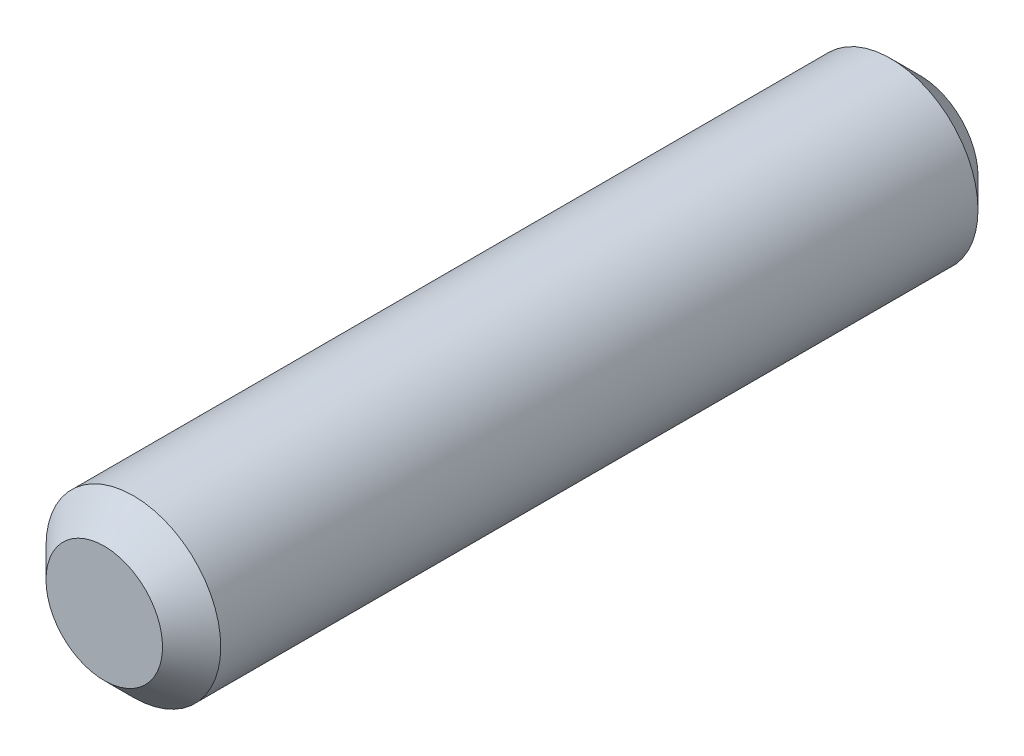
ISO-10303-21;
HEADER;
FILE_DESCRIPTION(('STEP AP214'),'2;1');
FILE_NAME('part.step','',(''),(''),'','','');
FILE_SCHEMA(('AUTOMOTIVE_DESIGN { 1 0 10303 214 1 1 1 1 }'));
ENDSEC;
DATA;
#1=APPLICATION_CONTEXT('core data for automotive mechanical design processes');
#2=APPLICATION_PROTOCOL_DEFINITION('international standard','automotive_design',2000,#1);
#3=PRODUCT_CONTEXT('',#1,'mechanical');
#4=PRODUCT('Part','Part','',(#3));
#5=PRODUCT_RELATED_PRODUCT_CATEGORY('part','',(#4));
#6=PRODUCT_DEFINITION_FORMATION('','',#4);
#7=PRODUCT_DEFINITION_CONTEXT('part definition',#1,'design');
#8=PRODUCT_DEFINITION('design','',#6,#7);
#9=PRODUCT_DEFINITION_SHAPE('','',#8);
#10=(LENGTH_UNIT() NAMED_UNIT(*) SI_UNIT(.MILLI.,.METRE.));
#11=(NAMED_UNIT(*) PLANE_ANGLE_UNIT() SI_UNIT($,.RADIAN.));
#12=(NAMED_UNIT(*) SI_UNIT($,.STERADIAN.) SOLID_ANGLE_UNIT());
#13=UNCERTAINTY_MEASURE_WITH_UNIT(LENGTH_MEASURE(1.E-05),#10,'distance_accuracy_value','');
#14=(GEOMETRIC_REPRESENTATION_CONTEXT(3) GLOBAL_UNCERTAINTY_ASSIGNED_CONTEXT((#13)) GLOBAL_UNIT_ASSIGNED_CONTEXT((#10,
#11,#12)) REPRESENTATION_CONTEXT('',''));
#15=CARTESIAN_POINT('',(0.,0.,0.));
#16=DIRECTION('',(0.,0.,1.));
#17=DIRECTION('',(1.,0.,0.));
#18=AXIS2_PLACEMENT_3D('',#15,#16,#17);
#19=CARTESIAN_POINT('',(0.,0.,-14.));
#20=DIRECTION('',(0.,0.,1.));
#21=DIRECTION('',(1.,0.,0.));
#22=AXIS2_PLACEMENT_3D('',#19,#20,#21);
#23=PLANE('',#22);
#24=CARTESIAN_POINT('',(0.,0.,-14.00000000001));
#25=DIRECTION('',(0.,0.,1.));
#26=DIRECTION('',(0.,-1.,0.));
#27=AXIS2_PLACEMENT_3D('',#24,#25,#26);
#28=CIRCLE('',#27,0.999999999976353);
#29=CARTESIAN_POINT('',(0.,-0.999999999976353,-14.00000000001));
#30=VERTEX_POINT('',#29);
#31=EDGE_CURVE('E17',#30,#30,#28,.T.);
#32=ORIENTED_EDGE('',*,*,#31,.F.);
#33=EDGE_LOOP('',(#32));
#34=FACE_BOUND('',#33,.T.);
#35=ADVANCED_FACE('F14',(#34),#23,.F.);
#36=CARTESIAN_POINT('',(0.,0.,0.));
#37=DIRECTION('',(0.,0.,-1.));
#38=DIRECTION('',(-1.,0.,0.));
#39=AXIS2_PLACEMENT_3D('',#36,#37,#38);
#40=PLANE('',#39);
#41=CARTESIAN_POINT('',(0.,0.,0.));
#42=DIRECTION('',(0.,0.,-1.));
#43=DIRECTION('',(-1.,0.,0.));
#44=AXIS2_PLACEMENT_3D('',#41,#42,#43);
#45=CIRCLE('',#44,1.0000000000332);
#46=CARTESIAN_POINT('',(-1.0000000000332,0.,0.));
#47=VERTEX_POINT('',#46);
#48=EDGE_CURVE('E26',#47,#47,#45,.T.);
#49=ORIENTED_EDGE('',*,*,#48,.F.);
#50=EDGE_LOOP('',(#49));
#51=FACE_BOUND('',#50,.T.);
#52=ADVANCED_FACE('F37',(#51),#40,.F.);
#53=CARTESIAN_POINT('',(0.,0.,-13.499999999965));
#54=DIRECTION('',(0.,0.,1.));
#55=DIRECTION('',(0.,-1.,0.));
#56=AXIS2_PLACEMENT_3D('',#53,#54,#55);
#57=CONICAL_SURFACE('',#56,1.50000000002137,0.785398163397448);
#58=CARTESIAN_POINT('',(0.,0.,-13.5));
#59=DIRECTION('',(0.,0.,1.));
#60=DIRECTION('',(1.,0.,0.));
#61=AXIS2_PLACEMENT_3D('',#58,#59,#60);
#62=CIRCLE('',#61,1.5);
#63=CARTESIAN_POINT('',(1.5,0.,-13.5));
#64=VERTEX_POINT('',#63);
#65=EDGE_CURVE('E21',#64,#64,#62,.T.);
#66=ORIENTED_EDGE('',*,*,#65,.F.);
#67=EDGE_LOOP('',(#66));
#68=FACE_BOUND('',#67,.T.);
#69=ORIENTED_EDGE('',*,*,#31,.T.);
#70=EDGE_LOOP('',(#69));
#71=FACE_BOUND('',#70,.T.);
#72=ADVANCED_FACE('F34',(#68,#71),#57,.T.);
#73=CARTESIAN_POINT('',(0.,0.,-0.499999999988177));
#74=DIRECTION('',(0.,0.,-1.));
#75=DIRECTION('',(-1.,0.,0.));
#76=AXIS2_PLACEMENT_3D('',#73,#74,#75);
#77=CONICAL_SURFACE('',#76,1.50000000002137,0.785398163397448);
#78=CARTESIAN_POINT('',(0.,0.,-0.5));
#79=DIRECTION('',(0.,0.,1.));
#80=DIRECTION('',(1.,0.,0.));
#81=AXIS2_PLACEMENT_3D('',#78,#79,#80);
#82=CIRCLE('',#81,1.5);
#83=CARTESIAN_POINT('',(1.5,0.,-0.5));
#84=VERTEX_POINT('',#83);
#85=EDGE_CURVE('E10',#84,#84,#82,.F.);
#86=ORIENTED_EDGE('',*,*,#85,.F.);
#87=EDGE_LOOP('',(#86));
#88=FACE_BOUND('',#87,.T.);
#89=ORIENTED_EDGE('',*,*,#48,.T.);
#90=EDGE_LOOP('',(#89));
#91=FACE_BOUND('',#90,.T.);
#92=ADVANCED_FACE('F45',(#88,#91),#77,.T.);
#93=CARTESIAN_POINT('',(0.,0.,0.));
#94=DIRECTION('',(0.,0.,1.));
#95=DIRECTION('',(1.,0.,0.));
#96=AXIS2_PLACEMENT_3D('',#93,#94,#95);
#97=CYLINDRICAL_SURFACE('',#96,1.5);
#98=ORIENTED_EDGE('',*,*,#85,.T.);
#99=EDGE_LOOP('',(#98));
#100=FACE_BOUND('',#99,.T.);
#101=ORIENTED_EDGE('',*,*,#65,.T.);
#102=EDGE_LOOP('',(#101));
#103=FACE_BOUND('',#102,.T.);
#104=ADVANCED_FACE('F43',(#100,#103),#97,.T.);
#105=CLOSED_SHELL('',(#35,#52,#72,#92,#104));
#106=MANIFOLD_SOLID_BREP('B1',#105);
#107=ADVANCED_BREP_SHAPE_REPRESENTATION('',(#18,#106),#14);
#108=SHAPE_DEFINITION_REPRESENTATION(#9,#107);
ENDSEC;
END-ISO-10303-21;
